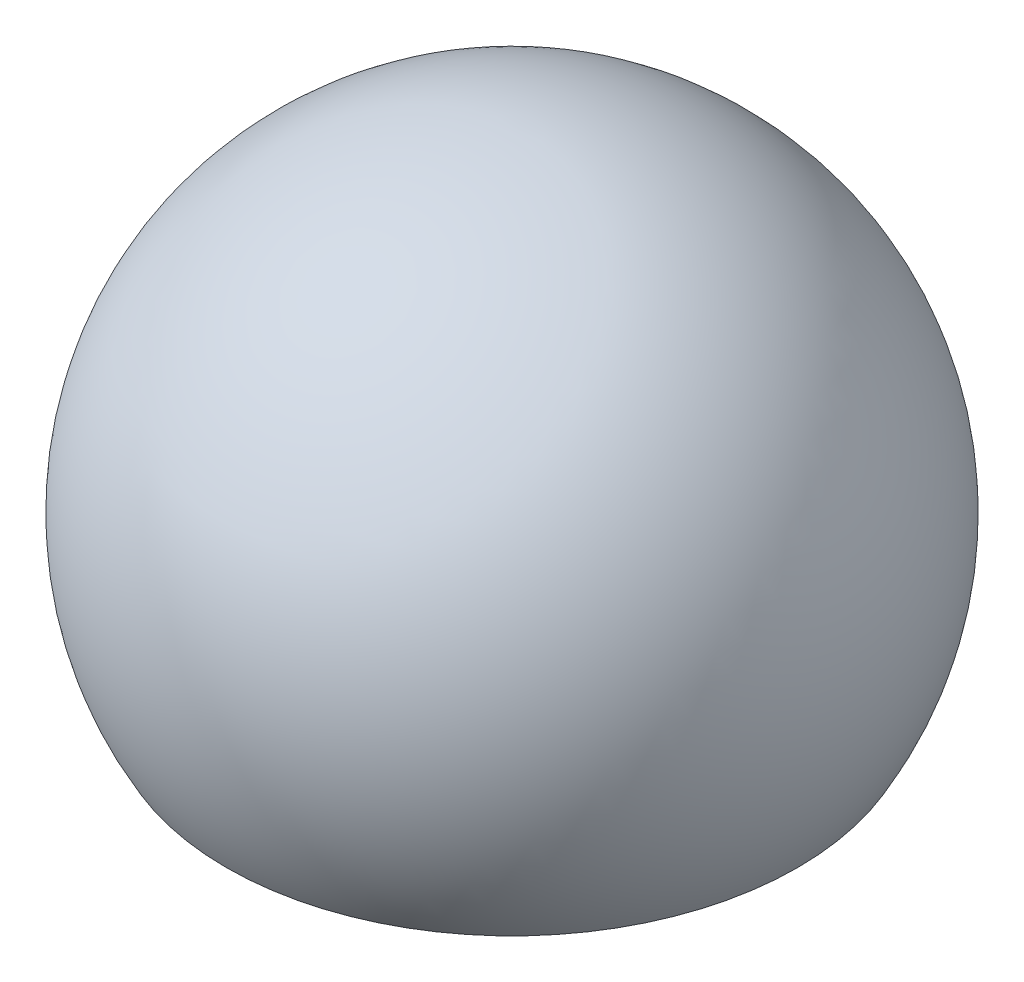
ISO-10303-21;
HEADER;
FILE_DESCRIPTION(('STEP AP214'),'2;1');
FILE_NAME('part.step','',(''),(''),'','','');
FILE_SCHEMA(('AUTOMOTIVE_DESIGN { 1 0 10303 214 1 1 1 1 }'));
ENDSEC;
DATA;
#1=APPLICATION_CONTEXT('core data for automotive mechanical design processes');
#2=APPLICATION_PROTOCOL_DEFINITION('international standard','automotive_design',2000,#1);
#3=PRODUCT_CONTEXT('',#1,'mechanical');
#4=PRODUCT('Part','Part','',(#3));
#5=PRODUCT_RELATED_PRODUCT_CATEGORY('part','',(#4));
#6=PRODUCT_DEFINITION_FORMATION('','',#4);
#7=PRODUCT_DEFINITION_CONTEXT('part definition',#1,'design');
#8=PRODUCT_DEFINITION('design','',#6,#7);
#9=PRODUCT_DEFINITION_SHAPE('','',#8);
#10=(LENGTH_UNIT() NAMED_UNIT(*) SI_UNIT(.MILLI.,.METRE.));
#11=(NAMED_UNIT(*) PLANE_ANGLE_UNIT() SI_UNIT($,.RADIAN.));
#12=(NAMED_UNIT(*) SI_UNIT($,.STERADIAN.) SOLID_ANGLE_UNIT());
#13=UNCERTAINTY_MEASURE_WITH_UNIT(LENGTH_MEASURE(1.E-05),#10,'distance_accuracy_value','');
#14=(GEOMETRIC_REPRESENTATION_CONTEXT(3) GLOBAL_UNCERTAINTY_ASSIGNED_CONTEXT((#13)) GLOBAL_UNIT_ASSIGNED_CONTEXT((#10,
#11,#12)) REPRESENTATION_CONTEXT('',''));
#15=CARTESIAN_POINT('',(0.,0.,0.));
#16=DIRECTION('',(0.,0.,1.));
#17=DIRECTION('',(1.,0.,0.));
#18=AXIS2_PLACEMENT_3D('',#15,#16,#17);
#19=CARTESIAN_POINT('',(0.,0.,0.));
#20=DIRECTION('',(0.,1.,0.));
#21=DIRECTION('',(1.,0.,0.));
#22=AXIS2_PLACEMENT_3D('',#19,#20,#21);
#23=SPHERICAL_SURFACE('',#22,12.7);
#24=CARTESIAN_POINT('',(0.,-6.35,0.));
#25=DIRECTION('',(0.,1.,0.));
#26=DIRECTION('',(0.,0.,1.));
#27=AXIS2_PLACEMENT_3D('',#24,#25,#26);
#28=CIRCLE('',#27,10.9985226280624);
#29=CARTESIAN_POINT('',(0.,-6.35,10.9985226280624));
#30=VERTEX_POINT('',#29);
#31=EDGE_CURVE('E12',#30,#30,#28,.T.);
#32=ORIENTED_EDGE('',*,*,#31,.T.);
#33=EDGE_LOOP('',(#32));
#34=FACE_BOUND('',#33,.T.);
#35=ADVANCED_FACE('F42',(#34),#23,.T.);
#36=CARTESIAN_POINT('',(-10.9985226280624,-6.35,-12.7));
#37=DIRECTION('',(0.,1.,0.));
#38=DIRECTION('',(0.,0.,1.));
#39=AXIS2_PLACEMENT_3D('',#36,#37,#38);
#40=PLANE('',#39);
#41=ORIENTED_EDGE('',*,*,#31,.F.);
#42=EDGE_LOOP('',(#41));
#43=FACE_BOUND('',#42,.T.);
#44=ADVANCED_FACE('F50',(#43),#40,.F.);
#45=CLOSED_SHELL('',(#35,#44));
#46=MANIFOLD_SOLID_BREP('B2',#45);
#47=ADVANCED_BREP_SHAPE_REPRESENTATION('',(#18,#46),#14);
#48=SHAPE_DEFINITION_REPRESENTATION(#9,#47);
ENDSEC;
END-ISO-10303-21;
